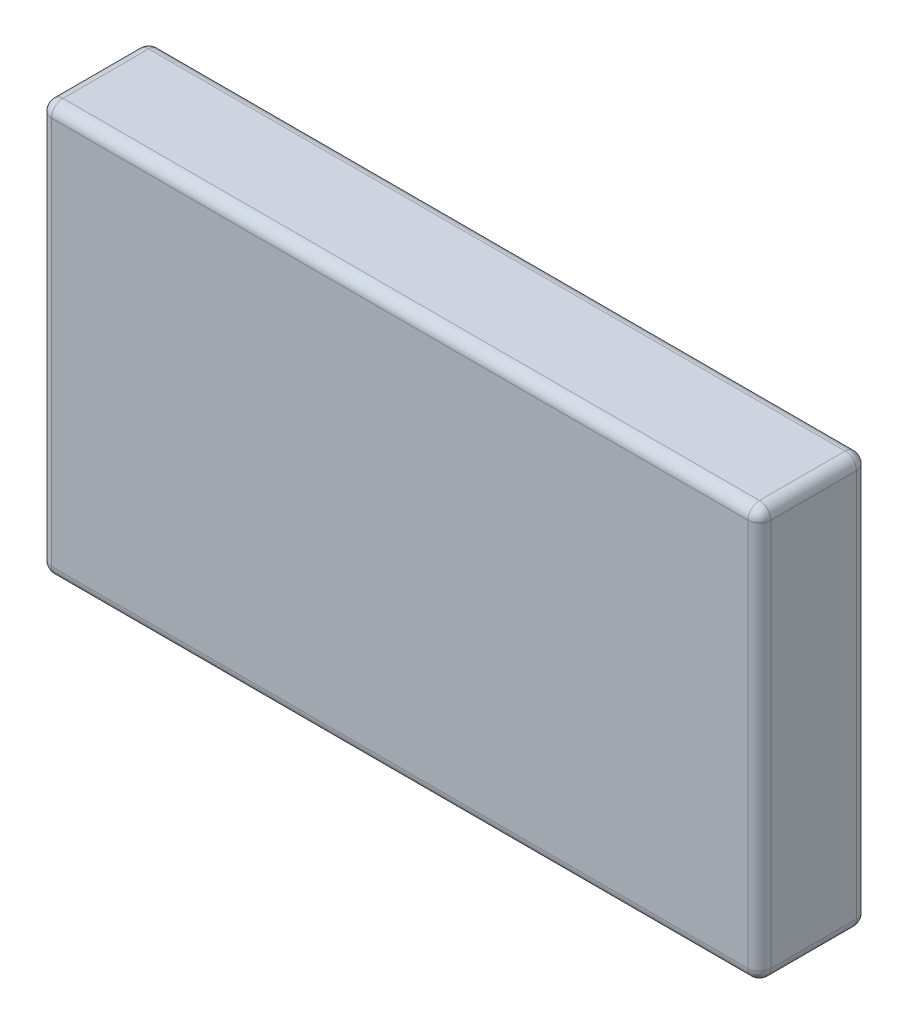
ISO-10303-21;
HEADER;
FILE_DESCRIPTION(('STEP AP214'),'2;1');
FILE_NAME('part.step','',(''),(''),'','','');
FILE_SCHEMA(('AUTOMOTIVE_DESIGN { 1 0 10303 214 1 1 1 1 }'));
ENDSEC;
DATA;
#1=APPLICATION_CONTEXT('core data for automotive mechanical design processes');
#2=APPLICATION_PROTOCOL_DEFINITION('international standard','automotive_design',2000,#1);
#3=PRODUCT_CONTEXT('',#1,'mechanical');
#4=PRODUCT('Part','Part','',(#3));
#5=PRODUCT_RELATED_PRODUCT_CATEGORY('part','',(#4));
#6=PRODUCT_DEFINITION_FORMATION('','',#4);
#7=PRODUCT_DEFINITION_CONTEXT('part definition',#1,'design');
#8=PRODUCT_DEFINITION('design','',#6,#7);
#9=PRODUCT_DEFINITION_SHAPE('','',#8);
#10=(LENGTH_UNIT() NAMED_UNIT(*) SI_UNIT(.MILLI.,.METRE.));
#11=(NAMED_UNIT(*) PLANE_ANGLE_UNIT() SI_UNIT($,.RADIAN.));
#12=(NAMED_UNIT(*) SI_UNIT($,.STERADIAN.) SOLID_ANGLE_UNIT());
#13=UNCERTAINTY_MEASURE_WITH_UNIT(LENGTH_MEASURE(1.E-05),#10,'distance_accuracy_value','');
#14=(GEOMETRIC_REPRESENTATION_CONTEXT(3) GLOBAL_UNCERTAINTY_ASSIGNED_CONTEXT((#13)) GLOBAL_UNIT_ASSIGNED_CONTEXT((#10,
#11,#12)) REPRESENTATION_CONTEXT('',''));
#15=CARTESIAN_POINT('',(0.,0.,0.));
#16=DIRECTION('',(0.,0.,1.));
#17=DIRECTION('',(1.,0.,0.));
#18=AXIS2_PLACEMENT_3D('',#15,#16,#17);
#19=CARTESIAN_POINT('',(-63.,36.,19.));
#20=DIRECTION('',(1.,0.,0.));
#21=DIRECTION('',(0.,1.,0.));
#22=AXIS2_PLACEMENT_3D('',#19,#20,#21);
#23=PLANE('',#22);
#24=DIRECTION('',(0.,-1.,0.));
#25=VECTOR('',#24,1.);
#26=CARTESIAN_POINT('',(-63.,36.,17.));
#27=LINE('',#26,#25);
#28=CARTESIAN_POINT('',(-63.,-34.,17.));
#29=VERTEX_POINT('',#28);
#30=CARTESIAN_POINT('',(-63.,34.,17.));
#31=VERTEX_POINT('',#30);
#32=EDGE_CURVE('E164',#29,#31,#27,.F.);
#33=ORIENTED_EDGE('',*,*,#32,.T.);
#34=DIRECTION('',(0.,0.,-1.));
#35=VECTOR('',#34,1.);
#36=CARTESIAN_POINT('',(-63.,34.,19.));
#37=LINE('',#36,#35);
#38=CARTESIAN_POINT('',(-63.,34.,2.));
#39=VERTEX_POINT('',#38);
#40=EDGE_CURVE('E167',#31,#39,#37,.T.);
#41=ORIENTED_EDGE('',*,*,#40,.T.);
#42=DIRECTION('',(0.,-1.,0.));
#43=VECTOR('',#42,1.);
#44=CARTESIAN_POINT('',(-63.,36.,2.));
#45=LINE('',#44,#43);
#46=CARTESIAN_POINT('',(-63.,-34.,2.));
#47=VERTEX_POINT('',#46);
#48=EDGE_CURVE('E138',#39,#47,#45,.T.);
#49=ORIENTED_EDGE('',*,*,#48,.T.);
#50=DIRECTION('',(0.,0.,-1.));
#51=VECTOR('',#50,1.);
#52=CARTESIAN_POINT('',(-63.,-34.,19.));
#53=LINE('',#52,#51);
#54=EDGE_CURVE('E158',#47,#29,#53,.F.);
#55=ORIENTED_EDGE('',*,*,#54,.T.);
#56=EDGE_LOOP('',(#33,#41,#49,#55));
#57=FACE_BOUND('',#56,.T.);
#58=ADVANCED_FACE('F39',(#57),#23,.F.);
#59=CARTESIAN_POINT('',(-63.,-36.,19.));
#60=DIRECTION('',(0.,1.,0.));
#61=DIRECTION('',(-1.,0.,0.));
#62=AXIS2_PLACEMENT_3D('',#59,#60,#61);
#63=PLANE('',#62);
#64=DIRECTION('',(1.,0.,0.));
#65=VECTOR('',#64,1.);
#66=CARTESIAN_POINT('',(-63.,-36.,2.));
#67=LINE('',#66,#65);
#68=CARTESIAN_POINT('',(-61.,-36.,2.));
#69=VERTEX_POINT('',#68);
#70=CARTESIAN_POINT('',(61.,-35.9999999999999,2.));
#71=VERTEX_POINT('',#70);
#72=EDGE_CURVE('E193',#69,#71,#67,.T.);
#73=ORIENTED_EDGE('',*,*,#72,.T.);
#74=DIRECTION('',(0.,0.,-1.));
#75=VECTOR('',#74,1.);
#76=CARTESIAN_POINT('',(61.,-35.9999999999999,19.));
#77=LINE('',#76,#75);
#78=CARTESIAN_POINT('',(61.,-35.9999999999999,17.));
#79=VERTEX_POINT('',#78);
#80=EDGE_CURVE('E197',#71,#79,#77,.F.);
#81=ORIENTED_EDGE('',*,*,#80,.T.);
#82=DIRECTION('',(1.,0.,0.));
#83=VECTOR('',#82,1.);
#84=CARTESIAN_POINT('',(-63.,-36.,17.));
#85=LINE('',#84,#83);
#86=CARTESIAN_POINT('',(-61.,-36.,17.));
#87=VERTEX_POINT('',#86);
#88=EDGE_CURVE('E190',#79,#87,#85,.F.);
#89=ORIENTED_EDGE('',*,*,#88,.T.);
#90=DIRECTION('',(0.,0.,-1.));
#91=VECTOR('',#90,1.);
#92=CARTESIAN_POINT('',(-61.,-36.,19.));
#93=LINE('',#92,#91);
#94=EDGE_CURVE('E187',#87,#69,#93,.T.);
#95=ORIENTED_EDGE('',*,*,#94,.T.);
#96=EDGE_LOOP('',(#73,#81,#89,#95));
#97=FACE_BOUND('',#96,.T.);
#98=ADVANCED_FACE('F377',(#97),#63,.F.);
#99=CARTESIAN_POINT('',(63.,36.,19.));
#100=DIRECTION('',(-1.,0.,0.));
#101=DIRECTION('',(0.,-1.,0.));
#102=AXIS2_PLACEMENT_3D('',#99,#100,#101);
#103=PLANE('',#102);
#104=DIRECTION('',(0.,0.,-1.));
#105=VECTOR('',#104,1.);
#106=CARTESIAN_POINT('',(63.,-33.9999999999999,19.));
#107=LINE('',#106,#105);
#108=CARTESIAN_POINT('',(63.,-33.9999999999999,17.));
#109=VERTEX_POINT('',#108);
#110=CARTESIAN_POINT('',(63.,-33.9999999999999,2.));
#111=VERTEX_POINT('',#110);
#112=EDGE_CURVE('E203',#109,#111,#107,.T.);
#113=ORIENTED_EDGE('',*,*,#112,.T.);
#114=DIRECTION('',(0.,1.,0.));
#115=VECTOR('',#114,1.);
#116=CARTESIAN_POINT('',(63.,36.,2.));
#117=LINE('',#116,#115);
#118=CARTESIAN_POINT('',(63.,34.,2.));
#119=VERTEX_POINT('',#118);
#120=EDGE_CURVE('E209',#111,#119,#117,.T.);
#121=ORIENTED_EDGE('',*,*,#120,.T.);
#122=DIRECTION('',(0.,0.,-1.));
#123=VECTOR('',#122,1.);
#124=CARTESIAN_POINT('',(63.,34.,19.));
#125=LINE('',#124,#123);
#126=CARTESIAN_POINT('',(63.,34.,17.));
#127=VERTEX_POINT('',#126);
#128=EDGE_CURVE('E206',#119,#127,#125,.F.);
#129=ORIENTED_EDGE('',*,*,#128,.T.);
#130=DIRECTION('',(0.,1.,0.));
#131=VECTOR('',#130,1.);
#132=CARTESIAN_POINT('',(63.,-35.9999999999999,17.));
#133=LINE('',#132,#131);
#134=EDGE_CURVE('E200',#127,#109,#133,.F.);
#135=ORIENTED_EDGE('',*,*,#134,.T.);
#136=EDGE_LOOP('',(#113,#121,#129,#135));
#137=FACE_BOUND('',#136,.T.);
#138=ADVANCED_FACE('F348',(#137),#103,.F.);
#139=CARTESIAN_POINT('',(-63.,36.,19.));
#140=DIRECTION('',(0.,-1.,0.));
#141=DIRECTION('',(0.,0.,-1.));
#142=AXIS2_PLACEMENT_3D('',#139,#140,#141);
#143=PLANE('',#142);
#144=DIRECTION('',(-1.,0.,0.));
#145=VECTOR('',#144,1.);
#146=CARTESIAN_POINT('',(-63.,36.,2.));
#147=LINE('',#146,#145);
#148=CARTESIAN_POINT('',(61.,36.,2.));
#149=VERTEX_POINT('',#148);
#150=CARTESIAN_POINT('',(-61.,36.,2.));
#151=VERTEX_POINT('',#150);
#152=EDGE_CURVE('E219',#149,#151,#147,.T.);
#153=ORIENTED_EDGE('',*,*,#152,.T.);
#154=DIRECTION('',(0.,0.,-1.));
#155=VECTOR('',#154,1.);
#156=CARTESIAN_POINT('',(-61.,36.,19.));
#157=LINE('',#156,#155);
#158=CARTESIAN_POINT('',(-61.,36.,17.));
#159=VERTEX_POINT('',#158);
#160=EDGE_CURVE('E223',#151,#159,#157,.F.);
#161=ORIENTED_EDGE('',*,*,#160,.T.);
#162=DIRECTION('',(-1.,0.,0.));
#163=VECTOR('',#162,1.);
#164=CARTESIAN_POINT('',(63.,36.,17.));
#165=LINE('',#164,#163);
#166=CARTESIAN_POINT('',(61.,36.,17.));
#167=VERTEX_POINT('',#166);
#168=EDGE_CURVE('E216',#159,#167,#165,.F.);
#169=ORIENTED_EDGE('',*,*,#168,.T.);
#170=DIRECTION('',(0.,0.,-1.));
#171=VECTOR('',#170,1.);
#172=CARTESIAN_POINT('',(61.,36.,19.));
#173=LINE('',#172,#171);
#174=EDGE_CURVE('E213',#167,#149,#173,.T.);
#175=ORIENTED_EDGE('',*,*,#174,.T.);
#176=EDGE_LOOP('',(#153,#161,#169,#175));
#177=FACE_BOUND('',#176,.T.);
#178=ADVANCED_FACE('F323',(#177),#143,.F.);
#179=CARTESIAN_POINT('',(0.,0.,19.));
#180=DIRECTION('',(0.,0.,1.));
#181=DIRECTION('',(1.,0.,0.));
#182=AXIS2_PLACEMENT_3D('',#179,#180,#181);
#183=PLANE('',#182);
#184=DIRECTION('',(-1.,0.,0.));
#185=VECTOR('',#184,1.);
#186=CARTESIAN_POINT('',(-63.,34.,19.));
#187=LINE('',#186,#185);
#188=CARTESIAN_POINT('',(61.,34.,19.));
#189=VERTEX_POINT('',#188);
#190=CARTESIAN_POINT('',(-61.,34.,19.));
#191=VERTEX_POINT('',#190);
#192=EDGE_CURVE('E64',#189,#191,#187,.T.);
#193=ORIENTED_EDGE('',*,*,#192,.T.);
#194=DIRECTION('',(0.,-1.,0.));
#195=VECTOR('',#194,1.);
#196=CARTESIAN_POINT('',(-61.,-36.,19.));
#197=LINE('',#196,#195);
#198=CARTESIAN_POINT('',(-61.,-34.,19.));
#199=VERTEX_POINT('',#198);
#200=EDGE_CURVE('E11',#191,#199,#197,.T.);
#201=ORIENTED_EDGE('',*,*,#200,.T.);
#202=DIRECTION('',(1.,0.,0.));
#203=VECTOR('',#202,1.);
#204=CARTESIAN_POINT('',(63.,-33.9999999999999,19.));
#205=LINE('',#204,#203);
#206=CARTESIAN_POINT('',(61.,-33.9999999999999,19.));
#207=VERTEX_POINT('',#206);
#208=EDGE_CURVE('E49',#199,#207,#205,.T.);
#209=ORIENTED_EDGE('',*,*,#208,.T.);
#210=DIRECTION('',(0.,1.,0.));
#211=VECTOR('',#210,1.);
#212=CARTESIAN_POINT('',(61.,36.,19.));
#213=LINE('',#212,#211);
#214=EDGE_CURVE('E226',#207,#189,#213,.T.);
#215=ORIENTED_EDGE('',*,*,#214,.T.);
#216=EDGE_LOOP('',(#193,#201,#209,#215));
#217=FACE_BOUND('',#216,.T.);
#218=ADVANCED_FACE('F337',(#217),#183,.T.);
#219=CARTESIAN_POINT('',(0.,0.,0.));
#220=DIRECTION('',(0.,0.,1.));
#221=DIRECTION('',(1.,0.,0.));
#222=AXIS2_PLACEMENT_3D('',#219,#220,#221);
#223=PLANE('',#222);
#224=DIRECTION('',(1.,0.,0.));
#225=VECTOR('',#224,1.);
#226=CARTESIAN_POINT('',(0.,-34.,0.));
#227=LINE('',#226,#225);
#228=CARTESIAN_POINT('',(61.,-33.9999999999999,0.));
#229=VERTEX_POINT('',#228);
#230=CARTESIAN_POINT('',(-61.,-34.,0.));
#231=VERTEX_POINT('',#230);
#232=EDGE_CURVE('E182',#229,#231,#227,.F.);
#233=ORIENTED_EDGE('',*,*,#232,.T.);
#234=DIRECTION('',(0.,-1.,0.));
#235=VECTOR('',#234,1.);
#236=CARTESIAN_POINT('',(-61.,0.,0.));
#237=LINE('',#236,#235);
#238=CARTESIAN_POINT('',(-61.,34.,0.));
#239=VERTEX_POINT('',#238);
#240=EDGE_CURVE('E140',#231,#239,#237,.F.);
#241=ORIENTED_EDGE('',*,*,#240,.T.);
#242=DIRECTION('',(-1.,0.,0.));
#243=VECTOR('',#242,1.);
#244=CARTESIAN_POINT('',(0.,34.,0.));
#245=LINE('',#244,#243);
#246=CARTESIAN_POINT('',(61.,34.,0.));
#247=VERTEX_POINT('',#246);
#248=EDGE_CURVE('E173',#239,#247,#245,.F.);
#249=ORIENTED_EDGE('',*,*,#248,.T.);
#250=DIRECTION('',(0.,1.,0.));
#251=VECTOR('',#250,1.);
#252=CARTESIAN_POINT('',(61.,0.,0.));
#253=LINE('',#252,#251);
#254=EDGE_CURVE('E179',#247,#229,#253,.F.);
#255=ORIENTED_EDGE('',*,*,#254,.T.);
#256=EDGE_LOOP('',(#233,#241,#249,#255));
#257=FACE_BOUND('',#256,.T.);
#258=ADVANCED_FACE('F535',(#257),#223,.F.);
#259=CARTESIAN_POINT('',(61.,0.,17.));
#260=DIRECTION('',(0.,-1.,0.));
#261=DIRECTION('',(1.,0.,0.));
#262=AXIS2_PLACEMENT_3D('',#259,#260,#261);
#263=CYLINDRICAL_SURFACE('',#262,2.);
#264=CARTESIAN_POINT('',(61.,34.,17.));
#265=DIRECTION('',(0.,1.,0.));
#266=DIRECTION('',(0.,0.,1.));
#267=AXIS2_PLACEMENT_3D('',#264,#265,#266);
#268=CIRCLE('',#267,2.);
#269=EDGE_CURVE('E43',#189,#127,#268,.T.);
#270=ORIENTED_EDGE('',*,*,#269,.F.);
#271=ORIENTED_EDGE('',*,*,#214,.F.);
#272=CARTESIAN_POINT('',(61.,-33.9999999999999,17.));
#273=DIRECTION('',(0.,-1.,0.));
#274=DIRECTION('',(0.,0.,-1.));
#275=AXIS2_PLACEMENT_3D('',#272,#273,#274);
#276=CIRCLE('',#275,2.);
#277=EDGE_CURVE('E299',#109,#207,#276,.T.);
#278=ORIENTED_EDGE('',*,*,#277,.F.);
#279=ORIENTED_EDGE('',*,*,#134,.F.);
#280=EDGE_LOOP('',(#270,#271,#278,#279));
#281=FACE_BOUND('',#280,.T.);
#282=ADVANCED_FACE('F41',(#281),#263,.T.);
#283=CARTESIAN_POINT('',(61.,34.,17.));
#284=DIRECTION('',(0.,0.,1.));
#285=DIRECTION('',(1.,0.,0.));
#286=AXIS2_PLACEMENT_3D('',#283,#284,#285);
#287=SPHERICAL_SURFACE('',#286,2.);
#288=CARTESIAN_POINT('',(61.,34.,17.));
#289=DIRECTION('',(1.,0.,0.));
#290=DIRECTION('',(0.,0.,-1.));
#291=AXIS2_PLACEMENT_3D('',#288,#289,#290);
#292=CIRCLE('',#291,2.);
#293=EDGE_CURVE('E292',#189,#167,#292,.F.);
#294=ORIENTED_EDGE('',*,*,#293,.F.);
#295=ORIENTED_EDGE('',*,*,#269,.T.);
#296=CARTESIAN_POINT('',(61.,34.,17.));
#297=DIRECTION('',(0.,0.,1.));
#298=DIRECTION('',(1.,0.,0.));
#299=AXIS2_PLACEMENT_3D('',#296,#297,#298);
#300=CIRCLE('',#299,2.);
#301=EDGE_CURVE('E296',#167,#127,#300,.F.);
#302=ORIENTED_EDGE('',*,*,#301,.F.);
#303=EDGE_LOOP('',(#294,#295,#302));
#304=FACE_BOUND('',#303,.T.);
#305=ADVANCED_FACE('F312',(#304),#287,.T.);
#306=CARTESIAN_POINT('',(61.,-33.9999999999999,17.));
#307=DIRECTION('',(0.,0.,1.));
#308=DIRECTION('',(1.,0.,0.));
#309=AXIS2_PLACEMENT_3D('',#306,#307,#308);
#310=SPHERICAL_SURFACE('',#309,2.);
#311=CARTESIAN_POINT('',(61.,-33.9999999999999,17.));
#312=DIRECTION('',(0.,0.,1.));
#313=DIRECTION('',(1.,0.,0.));
#314=AXIS2_PLACEMENT_3D('',#311,#312,#313);
#315=CIRCLE('',#314,2.);
#316=EDGE_CURVE('E284',#109,#79,#315,.F.);
#317=ORIENTED_EDGE('',*,*,#316,.F.);
#318=ORIENTED_EDGE('',*,*,#277,.T.);
#319=CARTESIAN_POINT('',(61.,-33.9999999999999,17.));
#320=DIRECTION('',(1.,0.,0.));
#321=DIRECTION('',(0.,0.,-1.));
#322=AXIS2_PLACEMENT_3D('',#319,#320,#321);
#323=CIRCLE('',#322,2.);
#324=EDGE_CURVE('E288',#79,#207,#323,.F.);
#325=ORIENTED_EDGE('',*,*,#324,.F.);
#326=EDGE_LOOP('',(#317,#318,#325));
#327=FACE_BOUND('',#326,.T.);
#328=ADVANCED_FACE('F340',(#327),#310,.T.);
#329=CARTESIAN_POINT('',(61.,34.,19.));
#330=DIRECTION('',(0.,0.,-1.));
#331=DIRECTION('',(-1.,0.,0.));
#332=AXIS2_PLACEMENT_3D('',#329,#330,#331);
#333=CYLINDRICAL_SURFACE('',#332,2.);
#334=ORIENTED_EDGE('',*,*,#301,.T.);
#335=ORIENTED_EDGE('',*,*,#128,.F.);
#336=CARTESIAN_POINT('',(61.,34.,2.));
#337=DIRECTION('',(0.,0.,-1.));
#338=DIRECTION('',(-1.,0.,0.));
#339=AXIS2_PLACEMENT_3D('',#336,#337,#338);
#340=CIRCLE('',#339,2.);
#341=EDGE_CURVE('E277',#149,#119,#340,.T.);
#342=ORIENTED_EDGE('',*,*,#341,.F.);
#343=ORIENTED_EDGE('',*,*,#174,.F.);
#344=EDGE_LOOP('',(#334,#335,#342,#343));
#345=FACE_BOUND('',#344,.T.);
#346=ADVANCED_FACE('F319',(#345),#333,.T.);
#347=CARTESIAN_POINT('',(0.,34.,17.));
#348=DIRECTION('',(1.,0.,0.));
#349=DIRECTION('',(0.,0.,-1.));
#350=AXIS2_PLACEMENT_3D('',#347,#348,#349);
#351=CYLINDRICAL_SURFACE('',#350,2.);
#352=ORIENTED_EDGE('',*,*,#293,.T.);
#353=ORIENTED_EDGE('',*,*,#168,.F.);
#354=CARTESIAN_POINT('',(-61.,34.,17.));
#355=DIRECTION('',(-1.,0.,0.));
#356=DIRECTION('',(0.,0.,1.));
#357=AXIS2_PLACEMENT_3D('',#354,#355,#356);
#358=CIRCLE('',#357,2.);
#359=EDGE_CURVE('E273',#191,#159,#358,.T.);
#360=ORIENTED_EDGE('',*,*,#359,.F.);
#361=ORIENTED_EDGE('',*,*,#192,.F.);
#362=EDGE_LOOP('',(#352,#353,#360,#361));
#363=FACE_BOUND('',#362,.T.);
#364=ADVANCED_FACE('F329',(#363),#351,.T.);
#365=CARTESIAN_POINT('',(-61.,0.,17.));
#366=DIRECTION('',(0.,1.,0.));
#367=DIRECTION('',(-1.,0.,0.));
#368=AXIS2_PLACEMENT_3D('',#365,#366,#367);
#369=CYLINDRICAL_SURFACE('',#368,2.);
#370=CARTESIAN_POINT('',(-61.,-34.,17.));
#371=DIRECTION('',(0.,-1.,0.));
#372=DIRECTION('',(0.,0.,-1.));
#373=AXIS2_PLACEMENT_3D('',#370,#371,#372);
#374=CIRCLE('',#373,2.);
#375=EDGE_CURVE('E266',#199,#29,#374,.T.);
#376=ORIENTED_EDGE('',*,*,#375,.F.);
#377=ORIENTED_EDGE('',*,*,#200,.F.);
#378=CARTESIAN_POINT('',(-61.,34.,17.));
#379=DIRECTION('',(0.,1.,0.));
#380=DIRECTION('',(0.,0.,1.));
#381=AXIS2_PLACEMENT_3D('',#378,#379,#380);
#382=CIRCLE('',#381,2.);
#383=EDGE_CURVE('E269',#31,#191,#382,.T.);
#384=ORIENTED_EDGE('',*,*,#383,.F.);
#385=ORIENTED_EDGE('',*,*,#32,.F.);
#386=EDGE_LOOP('',(#376,#377,#384,#385));
#387=FACE_BOUND('',#386,.T.);
#388=ADVANCED_FACE('F335',(#387),#369,.T.);
#389=CARTESIAN_POINT('',(0.,-34.,17.));
#390=DIRECTION('',(-1.,0.,0.));
#391=DIRECTION('',(0.,-1.,0.));
#392=AXIS2_PLACEMENT_3D('',#389,#390,#391);
#393=CYLINDRICAL_SURFACE('',#392,2.);
#394=ORIENTED_EDGE('',*,*,#324,.T.);
#395=ORIENTED_EDGE('',*,*,#208,.F.);
#396=CARTESIAN_POINT('',(-61.,-34.,17.));
#397=DIRECTION('',(-1.,0.,0.));
#398=DIRECTION('',(0.,0.,1.));
#399=AXIS2_PLACEMENT_3D('',#396,#397,#398);
#400=CIRCLE('',#399,2.);
#401=EDGE_CURVE('E57',#87,#199,#400,.T.);
#402=ORIENTED_EDGE('',*,*,#401,.F.);
#403=ORIENTED_EDGE('',*,*,#88,.F.);
#404=EDGE_LOOP('',(#394,#395,#402,#403));
#405=FACE_BOUND('',#404,.T.);
#406=ADVANCED_FACE('F479',(#405),#393,.T.);
#407=CARTESIAN_POINT('',(61.,-33.9999999999999,19.));
#408=DIRECTION('',(0.,0.,-1.));
#409=DIRECTION('',(-1.,0.,0.));
#410=AXIS2_PLACEMENT_3D('',#407,#408,#409);
#411=CYLINDRICAL_SURFACE('',#410,2.);
#412=ORIENTED_EDGE('',*,*,#316,.T.);
#413=ORIENTED_EDGE('',*,*,#80,.F.);
#414=CARTESIAN_POINT('',(61.,-33.9999999999999,2.));
#415=DIRECTION('',(0.,0.,-1.));
#416=DIRECTION('',(-1.,0.,0.));
#417=AXIS2_PLACEMENT_3D('',#414,#415,#416);
#418=CIRCLE('',#417,2.);
#419=EDGE_CURVE('E260',#111,#71,#418,.T.);
#420=ORIENTED_EDGE('',*,*,#419,.F.);
#421=ORIENTED_EDGE('',*,*,#112,.F.);
#422=EDGE_LOOP('',(#412,#413,#420,#421));
#423=FACE_BOUND('',#422,.T.);
#424=ADVANCED_FACE('F345',(#423),#411,.T.);
#425=CARTESIAN_POINT('',(61.,36.,2.));
#426=DIRECTION('',(0.,1.,0.));
#427=DIRECTION('',(-1.,0.,0.));
#428=AXIS2_PLACEMENT_3D('',#425,#426,#427);
#429=CYLINDRICAL_SURFACE('',#428,2.);
#430=CARTESIAN_POINT('',(61.,34.,2.));
#431=DIRECTION('',(0.,1.,0.));
#432=DIRECTION('',(0.,0.,1.));
#433=AXIS2_PLACEMENT_3D('',#430,#431,#432);
#434=CIRCLE('',#433,2.);
#435=EDGE_CURVE('E280',#119,#247,#434,.T.);
#436=ORIENTED_EDGE('',*,*,#435,.F.);
#437=ORIENTED_EDGE('',*,*,#120,.F.);
#438=CARTESIAN_POINT('',(61.,-33.9999999999999,2.));
#439=DIRECTION('',(0.,-1.,0.));
#440=DIRECTION('',(0.,0.,-1.));
#441=AXIS2_PLACEMENT_3D('',#438,#439,#440);
#442=CIRCLE('',#441,2.);
#443=EDGE_CURVE('E256',#229,#111,#442,.T.);
#444=ORIENTED_EDGE('',*,*,#443,.F.);
#445=ORIENTED_EDGE('',*,*,#254,.F.);
#446=EDGE_LOOP('',(#436,#437,#444,#445));
#447=FACE_BOUND('',#446,.T.);
#448=ADVANCED_FACE('F352',(#447),#429,.T.);
#449=CARTESIAN_POINT('',(61.,34.,2.));
#450=DIRECTION('',(0.,0.,1.));
#451=DIRECTION('',(1.,0.,0.));
#452=AXIS2_PLACEMENT_3D('',#449,#450,#451);
#453=SPHERICAL_SURFACE('',#452,2.);
#454=ORIENTED_EDGE('',*,*,#341,.T.);
#455=ORIENTED_EDGE('',*,*,#435,.T.);
#456=CARTESIAN_POINT('',(61.,34.,2.));
#457=DIRECTION('',(1.,0.,0.));
#458=DIRECTION('',(0.,0.,-1.));
#459=AXIS2_PLACEMENT_3D('',#456,#457,#458);
#460=CIRCLE('',#459,2.);
#461=EDGE_CURVE('E252',#149,#247,#460,.F.);
#462=ORIENTED_EDGE('',*,*,#461,.F.);
#463=EDGE_LOOP('',(#454,#455,#462));
#464=FACE_BOUND('',#463,.T.);
#465=ADVANCED_FACE('F356',(#464),#453,.T.);
#466=CARTESIAN_POINT('',(-61.,34.,17.));
#467=DIRECTION('',(0.,0.,1.));
#468=DIRECTION('',(1.,0.,0.));
#469=AXIS2_PLACEMENT_3D('',#466,#467,#468);
#470=SPHERICAL_SURFACE('',#469,2.);
#471=ORIENTED_EDGE('',*,*,#383,.T.);
#472=ORIENTED_EDGE('',*,*,#359,.T.);
#473=CARTESIAN_POINT('',(-61.,34.,17.));
#474=DIRECTION('',(0.,0.,1.));
#475=DIRECTION('',(1.,0.,0.));
#476=AXIS2_PLACEMENT_3D('',#473,#474,#475);
#477=CIRCLE('',#476,2.);
#478=EDGE_CURVE('E248',#31,#159,#477,.F.);
#479=ORIENTED_EDGE('',*,*,#478,.F.);
#480=EDGE_LOOP('',(#471,#472,#479));
#481=FACE_BOUND('',#480,.T.);
#482=ADVANCED_FACE('F333',(#481),#470,.T.);
#483=CARTESIAN_POINT('',(-61.,-34.,17.));
#484=DIRECTION('',(0.,0.,1.));
#485=DIRECTION('',(1.,0.,0.));
#486=AXIS2_PLACEMENT_3D('',#483,#484,#485);
#487=SPHERICAL_SURFACE('',#486,2.);
#488=ORIENTED_EDGE('',*,*,#401,.T.);
#489=ORIENTED_EDGE('',*,*,#375,.T.);
#490=CARTESIAN_POINT('',(-61.,-34.,17.));
#491=DIRECTION('',(0.,0.,1.));
#492=DIRECTION('',(1.,0.,0.));
#493=AXIS2_PLACEMENT_3D('',#490,#491,#492);
#494=CIRCLE('',#493,2.);
#495=EDGE_CURVE('E160',#87,#29,#494,.F.);
#496=ORIENTED_EDGE('',*,*,#495,.F.);
#497=EDGE_LOOP('',(#488,#489,#496));
#498=FACE_BOUND('',#497,.T.);
#499=ADVANCED_FACE('F437',(#498),#487,.T.);
#500=CARTESIAN_POINT('',(61.,-33.9999999999999,2.));
#501=DIRECTION('',(0.,0.,1.));
#502=DIRECTION('',(1.,0.,0.));
#503=AXIS2_PLACEMENT_3D('',#500,#501,#502);
#504=SPHERICAL_SURFACE('',#503,2.);
#505=ORIENTED_EDGE('',*,*,#443,.T.);
#506=ORIENTED_EDGE('',*,*,#419,.T.);
#507=CARTESIAN_POINT('',(61.,-33.9999999999999,2.));
#508=DIRECTION('',(1.,0.,0.));
#509=DIRECTION('',(0.,0.,-1.));
#510=AXIS2_PLACEMENT_3D('',#507,#508,#509);
#511=CIRCLE('',#510,2.);
#512=EDGE_CURVE('E243',#229,#71,#511,.F.);
#513=ORIENTED_EDGE('',*,*,#512,.F.);
#514=EDGE_LOOP('',(#505,#506,#513));
#515=FACE_BOUND('',#514,.T.);
#516=ADVANCED_FACE('F428',(#515),#504,.T.);
#517=CARTESIAN_POINT('',(-63.,34.,2.));
#518=DIRECTION('',(-1.,0.,0.));
#519=DIRECTION('',(0.,0.,1.));
#520=AXIS2_PLACEMENT_3D('',#517,#518,#519);
#521=CYLINDRICAL_SURFACE('',#520,2.);
#522=ORIENTED_EDGE('',*,*,#461,.T.);
#523=ORIENTED_EDGE('',*,*,#248,.F.);
#524=CARTESIAN_POINT('',(-61.,34.,2.));
#525=DIRECTION('',(-1.,0.,0.));
#526=DIRECTION('',(0.,0.,1.));
#527=AXIS2_PLACEMENT_3D('',#524,#525,#526);
#528=CIRCLE('',#527,2.);
#529=EDGE_CURVE('E239',#151,#239,#528,.T.);
#530=ORIENTED_EDGE('',*,*,#529,.F.);
#531=ORIENTED_EDGE('',*,*,#152,.F.);
#532=EDGE_LOOP('',(#522,#523,#530,#531));
#533=FACE_BOUND('',#532,.T.);
#534=ADVANCED_FACE('F359',(#533),#521,.T.);
#535=CARTESIAN_POINT('',(-61.,34.,19.));
#536=DIRECTION('',(0.,0.,-1.));
#537=DIRECTION('',(-1.,0.,0.));
#538=AXIS2_PLACEMENT_3D('',#535,#536,#537);
#539=CYLINDRICAL_SURFACE('',#538,2.);
#540=ORIENTED_EDGE('',*,*,#478,.T.);
#541=ORIENTED_EDGE('',*,*,#160,.F.);
#542=CARTESIAN_POINT('',(-61.,34.,2.));
#543=DIRECTION('',(0.,0.,-1.));
#544=DIRECTION('',(-1.,0.,0.));
#545=AXIS2_PLACEMENT_3D('',#542,#543,#544);
#546=CIRCLE('',#545,2.);
#547=EDGE_CURVE('E155',#39,#151,#546,.T.);
#548=ORIENTED_EDGE('',*,*,#547,.F.);
#549=ORIENTED_EDGE('',*,*,#40,.F.);
#550=EDGE_LOOP('',(#540,#541,#548,#549));
#551=FACE_BOUND('',#550,.T.);
#552=ADVANCED_FACE('F364',(#551),#539,.T.);
#553=CARTESIAN_POINT('',(-61.,-34.,19.));
#554=DIRECTION('',(0.,0.,-1.));
#555=DIRECTION('',(-1.,0.,0.));
#556=AXIS2_PLACEMENT_3D('',#553,#554,#555);
#557=CYLINDRICAL_SURFACE('',#556,2.);
#558=ORIENTED_EDGE('',*,*,#495,.T.);
#559=ORIENTED_EDGE('',*,*,#54,.F.);
#560=CARTESIAN_POINT('',(-61.,-34.,2.));
#561=DIRECTION('',(0.,0.,-1.));
#562=DIRECTION('',(-1.,0.,0.));
#563=AXIS2_PLACEMENT_3D('',#560,#561,#562);
#564=CIRCLE('',#563,2.);
#565=EDGE_CURVE('E147',#69,#47,#564,.T.);
#566=ORIENTED_EDGE('',*,*,#565,.F.);
#567=ORIENTED_EDGE('',*,*,#94,.F.);
#568=EDGE_LOOP('',(#558,#559,#566,#567));
#569=FACE_BOUND('',#568,.T.);
#570=ADVANCED_FACE('F159',(#569),#557,.T.);
#571=CARTESIAN_POINT('',(-63.,-34.,2.));
#572=DIRECTION('',(1.,0.,0.));
#573=DIRECTION('',(0.,1.,0.));
#574=AXIS2_PLACEMENT_3D('',#571,#572,#573);
#575=CYLINDRICAL_SURFACE('',#574,2.);
#576=ORIENTED_EDGE('',*,*,#512,.T.);
#577=ORIENTED_EDGE('',*,*,#72,.F.);
#578=CARTESIAN_POINT('',(-61.,-34.,2.));
#579=DIRECTION('',(-1.,0.,0.));
#580=DIRECTION('',(0.,0.,1.));
#581=AXIS2_PLACEMENT_3D('',#578,#579,#580);
#582=CIRCLE('',#581,2.);
#583=EDGE_CURVE('E151',#231,#69,#582,.T.);
#584=ORIENTED_EDGE('',*,*,#583,.F.);
#585=ORIENTED_EDGE('',*,*,#232,.F.);
#586=EDGE_LOOP('',(#576,#577,#584,#585));
#587=FACE_BOUND('',#586,.T.);
#588=ADVANCED_FACE('F367',(#587),#575,.T.);
#589=CARTESIAN_POINT('',(-61.,34.,2.));
#590=DIRECTION('',(0.,0.,1.));
#591=DIRECTION('',(1.,0.,0.));
#592=AXIS2_PLACEMENT_3D('',#589,#590,#591);
#593=SPHERICAL_SURFACE('',#592,2.);
#594=ORIENTED_EDGE('',*,*,#547,.T.);
#595=ORIENTED_EDGE('',*,*,#529,.T.);
#596=CARTESIAN_POINT('',(-61.,34.,2.));
#597=DIRECTION('',(0.,1.,0.));
#598=DIRECTION('',(0.,0.,1.));
#599=AXIS2_PLACEMENT_3D('',#596,#597,#598);
#600=CIRCLE('',#599,2.);
#601=EDGE_CURVE('E144',#39,#239,#600,.F.);
#602=ORIENTED_EDGE('',*,*,#601,.F.);
#603=EDGE_LOOP('',(#594,#595,#602));
#604=FACE_BOUND('',#603,.T.);
#605=ADVANCED_FACE('F365',(#604),#593,.T.);
#606=CARTESIAN_POINT('',(-61.,-34.,2.));
#607=DIRECTION('',(0.,0.,1.));
#608=DIRECTION('',(1.,0.,0.));
#609=AXIS2_PLACEMENT_3D('',#606,#607,#608);
#610=SPHERICAL_SURFACE('',#609,2.);
#611=ORIENTED_EDGE('',*,*,#583,.T.);
#612=ORIENTED_EDGE('',*,*,#565,.T.);
#613=CARTESIAN_POINT('',(-61.,-34.,2.));
#614=DIRECTION('',(0.,-1.,0.));
#615=DIRECTION('',(0.,0.,-1.));
#616=AXIS2_PLACEMENT_3D('',#613,#614,#615);
#617=CIRCLE('',#616,2.);
#618=EDGE_CURVE('E134',#231,#47,#617,.F.);
#619=ORIENTED_EDGE('',*,*,#618,.F.);
#620=EDGE_LOOP('',(#611,#612,#619));
#621=FACE_BOUND('',#620,.T.);
#622=ADVANCED_FACE('F149',(#621),#610,.T.);
#623=CARTESIAN_POINT('',(-61.,36.,2.));
#624=DIRECTION('',(0.,-1.,0.));
#625=DIRECTION('',(1.,0.,0.));
#626=AXIS2_PLACEMENT_3D('',#623,#624,#625);
#627=CYLINDRICAL_SURFACE('',#626,2.);
#628=ORIENTED_EDGE('',*,*,#601,.T.);
#629=ORIENTED_EDGE('',*,*,#240,.F.);
#630=ORIENTED_EDGE('',*,*,#618,.T.);
#631=ORIENTED_EDGE('',*,*,#48,.F.);
#632=EDGE_LOOP('',(#628,#629,#630,#631));
#633=FACE_BOUND('',#632,.T.);
#634=ADVANCED_FACE('F136',(#633),#627,.T.);
#635=CLOSED_SHELL('',(#58,#98,#138,#178,#218,#258,#282,#305,#328,#346,#364,#388,#406,#424,#448,
#465,#482,#499,#516,#534,#552,#570,#588,#605,#622,#634));
#636=MANIFOLD_SOLID_BREP('B2',#635);
#637=ADVANCED_BREP_SHAPE_REPRESENTATION('',(#18,#636),#14);
#638=SHAPE_DEFINITION_REPRESENTATION(#9,#637);
ENDSEC;
END-ISO-10303-21;
